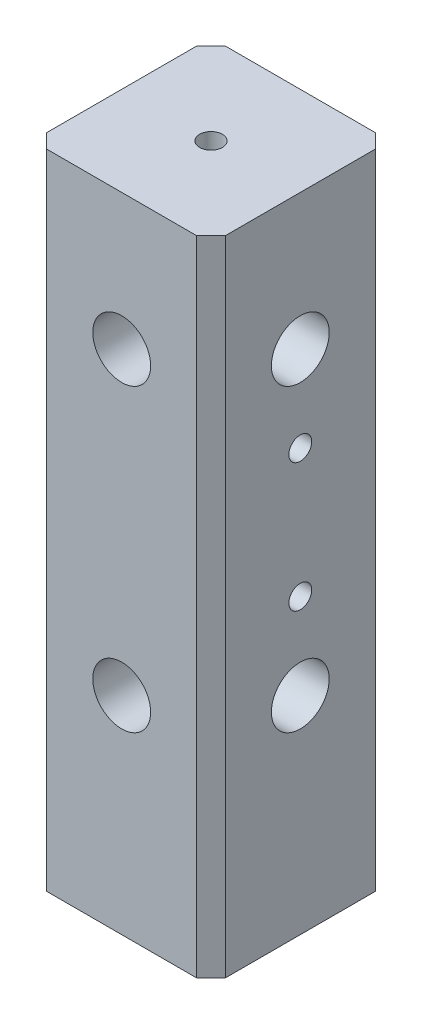
ISO-10303-21;
HEADER;
FILE_DESCRIPTION(('STEP AP214'),'2;1');
FILE_NAME('part.step','',(''),(''),'','','');
FILE_SCHEMA(('AUTOMOTIVE_DESIGN { 1 0 10303 214 1 1 1 1 }'));
ENDSEC;
DATA;
#1=APPLICATION_CONTEXT('core data for automotive mechanical design processes');
#2=APPLICATION_PROTOCOL_DEFINITION('international standard','automotive_design',2000,#1);
#3=PRODUCT_CONTEXT('',#1,'mechanical');
#4=PRODUCT('Part','Part','',(#3));
#5=PRODUCT_RELATED_PRODUCT_CATEGORY('part','',(#4));
#6=PRODUCT_DEFINITION_FORMATION('','',#4);
#7=PRODUCT_DEFINITION_CONTEXT('part definition',#1,'design');
#8=PRODUCT_DEFINITION('design','',#6,#7);
#9=PRODUCT_DEFINITION_SHAPE('','',#8);
#10=(LENGTH_UNIT() NAMED_UNIT(*) SI_UNIT(.MILLI.,.METRE.));
#11=(NAMED_UNIT(*) PLANE_ANGLE_UNIT() SI_UNIT($,.RADIAN.));
#12=(NAMED_UNIT(*) SI_UNIT($,.STERADIAN.) SOLID_ANGLE_UNIT());
#13=UNCERTAINTY_MEASURE_WITH_UNIT(LENGTH_MEASURE(1.E-05),#10,'distance_accuracy_value','');
#14=(GEOMETRIC_REPRESENTATION_CONTEXT(3) GLOBAL_UNCERTAINTY_ASSIGNED_CONTEXT((#13)) GLOBAL_UNIT_ASSIGNED_CONTEXT((#10,
#11,#12)) REPRESENTATION_CONTEXT('',''));
#15=CARTESIAN_POINT('',(0.,0.,0.));
#16=DIRECTION('',(0.,0.,1.));
#17=DIRECTION('',(1.,0.,0.));
#18=AXIS2_PLACEMENT_3D('',#15,#16,#17);
#19=CARTESIAN_POINT('',(12.5,90.,-12.5));
#20=DIRECTION('',(-1.,0.,0.));
#21=DIRECTION('',(0.,0.,1.));
#22=AXIS2_PLACEMENT_3D('',#19,#20,#21);
#23=PLANE('',#22);
#24=CARTESIAN_POINT('',(12.5,41.,0.));
#25=DIRECTION('',(1.,0.,0.));
#26=DIRECTION('',(0.,0.,-1.));
#27=AXIS2_PLACEMENT_3D('',#24,#25,#26);
#28=CIRCLE('',#27,1.6);
#29=CARTESIAN_POINT('',(12.5,41.,-1.6));
#30=VERTEX_POINT('',#29);
#31=EDGE_CURVE('E207',#30,#30,#28,.T.);
#32=ORIENTED_EDGE('',*,*,#31,.F.);
#33=EDGE_LOOP('',(#32));
#34=FACE_BOUND('',#33,.T.);
#35=CARTESIAN_POINT('',(12.5,59.,0.));
#36=DIRECTION('',(1.,0.,0.));
#37=DIRECTION('',(0.,0.,-1.));
#38=AXIS2_PLACEMENT_3D('',#35,#36,#37);
#39=CIRCLE('',#38,1.6);
#40=CARTESIAN_POINT('',(12.5,59.,-1.6));
#41=VERTEX_POINT('',#40);
#42=EDGE_CURVE('E201',#41,#41,#39,.T.);
#43=ORIENTED_EDGE('',*,*,#42,.F.);
#44=EDGE_LOOP('',(#43));
#45=FACE_BOUND('',#44,.T.);
#46=CARTESIAN_POINT('',(12.5,71.,0.));
#47=DIRECTION('',(1.,0.,0.));
#48=DIRECTION('',(0.,0.,-1.));
#49=AXIS2_PLACEMENT_3D('',#46,#47,#48);
#50=CIRCLE('',#49,4.05);
#51=CARTESIAN_POINT('',(12.5,71.,-4.05));
#52=VERTEX_POINT('',#51);
#53=EDGE_CURVE('E181',#52,#52,#50,.T.);
#54=ORIENTED_EDGE('',*,*,#53,.F.);
#55=EDGE_LOOP('',(#54));
#56=FACE_BOUND('',#55,.T.);
#57=CARTESIAN_POINT('',(12.5,29.,0.));
#58=DIRECTION('',(1.,0.,0.));
#59=DIRECTION('',(0.,0.,-1.));
#60=AXIS2_PLACEMENT_3D('',#57,#58,#59);
#61=CIRCLE('',#60,4.05);
#62=CARTESIAN_POINT('',(12.5,29.,-4.05));
#63=VERTEX_POINT('',#62);
#64=EDGE_CURVE('E133',#63,#63,#61,.T.);
#65=ORIENTED_EDGE('',*,*,#64,.F.);
#66=EDGE_LOOP('',(#65));
#67=FACE_BOUND('',#66,.T.);
#68=DIRECTION('',(0.,0.,-1.));
#69=VECTOR('',#68,1.);
#70=CARTESIAN_POINT('',(12.5,90.,-12.5));
#71=LINE('',#70,#69);
#72=CARTESIAN_POINT('',(12.5,90.,10.5));
#73=VERTEX_POINT('',#72);
#74=CARTESIAN_POINT('',(12.5,90.,-10.5));
#75=VERTEX_POINT('',#74);
#76=EDGE_CURVE('E120',#73,#75,#71,.T.);
#77=ORIENTED_EDGE('',*,*,#76,.F.);
#78=DIRECTION('',(0.,-1.,0.));
#79=VECTOR('',#78,1.);
#80=CARTESIAN_POINT('',(12.5,90.,10.5));
#81=LINE('',#80,#79);
#82=CARTESIAN_POINT('',(12.5,0.,10.5));
#83=VERTEX_POINT('',#82);
#84=EDGE_CURVE('E105',#73,#83,#81,.T.);
#85=ORIENTED_EDGE('',*,*,#84,.T.);
#86=DIRECTION('',(0.,0.,-1.));
#87=VECTOR('',#86,1.);
#88=CARTESIAN_POINT('',(12.5,0.,-12.5));
#89=LINE('',#88,#87);
#90=CARTESIAN_POINT('',(12.5,0.,-10.5));
#91=VERTEX_POINT('',#90);
#92=EDGE_CURVE('E117',#83,#91,#89,.T.);
#93=ORIENTED_EDGE('',*,*,#92,.T.);
#94=DIRECTION('',(0.,1.,0.));
#95=VECTOR('',#94,1.);
#96=CARTESIAN_POINT('',(12.5,90.,-10.5));
#97=LINE('',#96,#95);
#98=EDGE_CURVE('E122',#91,#75,#97,.T.);
#99=ORIENTED_EDGE('',*,*,#98,.T.);
#100=EDGE_LOOP('',(#77,#85,#93,#99));
#101=FACE_BOUND('',#100,.T.);
#102=ADVANCED_FACE('F35',(#34,#45,#56,#67,#101),#23,.F.);
#103=CARTESIAN_POINT('',(12.5,90.,-12.5));
#104=DIRECTION('',(0.,0.,1.));
#105=DIRECTION('',(1.,0.,0.));
#106=AXIS2_PLACEMENT_3D('',#103,#104,#105);
#107=PLANE('',#106);
#108=DIRECTION('',(-1.,0.,0.));
#109=VECTOR('',#108,1.);
#110=CARTESIAN_POINT('',(12.5,90.,-12.5));
#111=LINE('',#110,#109);
#112=CARTESIAN_POINT('',(10.5,90.,-12.5));
#113=VERTEX_POINT('',#112);
#114=CARTESIAN_POINT('',(-10.5,90.,-12.5));
#115=VERTEX_POINT('',#114);
#116=EDGE_CURVE('E166',#113,#115,#111,.T.);
#117=ORIENTED_EDGE('',*,*,#116,.F.);
#118=DIRECTION('',(0.,-1.,0.));
#119=VECTOR('',#118,1.);
#120=CARTESIAN_POINT('',(10.5,90.,-12.5));
#121=LINE('',#120,#119);
#122=CARTESIAN_POINT('',(10.5,0.,-12.5));
#123=VERTEX_POINT('',#122);
#124=EDGE_CURVE('E159',#113,#123,#121,.T.);
#125=ORIENTED_EDGE('',*,*,#124,.T.);
#126=DIRECTION('',(-1.,0.,0.));
#127=VECTOR('',#126,1.);
#128=CARTESIAN_POINT('',(12.5,0.,-12.5));
#129=LINE('',#128,#127);
#130=CARTESIAN_POINT('',(-10.5,0.,-12.5));
#131=VERTEX_POINT('',#130);
#132=EDGE_CURVE('E126',#123,#131,#129,.T.);
#133=ORIENTED_EDGE('',*,*,#132,.T.);
#134=DIRECTION('',(0.,1.,0.));
#135=VECTOR('',#134,1.);
#136=CARTESIAN_POINT('',(-10.5,90.,-12.5));
#137=LINE('',#136,#135);
#138=EDGE_CURVE('E157',#131,#115,#137,.T.);
#139=ORIENTED_EDGE('',*,*,#138,.T.);
#140=EDGE_LOOP('',(#117,#125,#133,#139));
#141=FACE_BOUND('',#140,.T.);
#142=ADVANCED_FACE('F164',(#141),#107,.F.);
#143=CARTESIAN_POINT('',(-12.5,90.,-12.5));
#144=DIRECTION('',(1.,0.,0.));
#145=DIRECTION('',(0.,0.,-1.));
#146=AXIS2_PLACEMENT_3D('',#143,#144,#145);
#147=PLANE('',#146);
#148=DIRECTION('',(0.,0.,1.));
#149=VECTOR('',#148,1.);
#150=CARTESIAN_POINT('',(-12.5,90.,-12.5));
#151=LINE('',#150,#149);
#152=CARTESIAN_POINT('',(-12.5,90.,-10.5));
#153=VERTEX_POINT('',#152);
#154=CARTESIAN_POINT('',(-12.5,90.,10.5));
#155=VERTEX_POINT('',#154);
#156=EDGE_CURVE('E174',#153,#155,#151,.T.);
#157=ORIENTED_EDGE('',*,*,#156,.F.);
#158=DIRECTION('',(0.,-1.,0.));
#159=VECTOR('',#158,1.);
#160=CARTESIAN_POINT('',(-12.5,90.,-10.5));
#161=LINE('',#160,#159);
#162=CARTESIAN_POINT('',(-12.5,0.,-10.5));
#163=VERTEX_POINT('',#162);
#164=EDGE_CURVE('E11',#153,#163,#161,.T.);
#165=ORIENTED_EDGE('',*,*,#164,.T.);
#166=DIRECTION('',(0.,0.,1.));
#167=VECTOR('',#166,1.);
#168=CARTESIAN_POINT('',(-12.5,0.,-12.5));
#169=LINE('',#168,#167);
#170=CARTESIAN_POINT('',(-12.5,0.,10.5));
#171=VERTEX_POINT('',#170);
#172=EDGE_CURVE('E130',#163,#171,#169,.T.);
#173=ORIENTED_EDGE('',*,*,#172,.T.);
#174=DIRECTION('',(0.,1.,0.));
#175=VECTOR('',#174,1.);
#176=CARTESIAN_POINT('',(-12.5,90.,10.5));
#177=LINE('',#176,#175);
#178=EDGE_CURVE('E43',#171,#155,#177,.T.);
#179=ORIENTED_EDGE('',*,*,#178,.T.);
#180=EDGE_LOOP('',(#157,#165,#173,#179));
#181=FACE_BOUND('',#180,.T.);
#182=ADVANCED_FACE('F173',(#181),#147,.F.);
#183=CARTESIAN_POINT('',(12.5,90.,12.5));
#184=DIRECTION('',(0.,0.,-1.));
#185=DIRECTION('',(-1.,0.,0.));
#186=AXIS2_PLACEMENT_3D('',#183,#184,#185);
#187=PLANE('',#186);
#188=CARTESIAN_POINT('',(0.,71.,12.5));
#189=DIRECTION('',(0.,0.,1.));
#190=DIRECTION('',(1.,0.,0.));
#191=AXIS2_PLACEMENT_3D('',#188,#189,#190);
#192=CIRCLE('',#191,4.05);
#193=CARTESIAN_POINT('',(4.05,71.,12.5));
#194=VERTEX_POINT('',#193);
#195=EDGE_CURVE('E192',#194,#194,#192,.T.);
#196=ORIENTED_EDGE('',*,*,#195,.F.);
#197=EDGE_LOOP('',(#196));
#198=FACE_BOUND('',#197,.T.);
#199=CARTESIAN_POINT('',(0.,29.,12.5));
#200=DIRECTION('',(0.,0.,1.));
#201=DIRECTION('',(1.,0.,0.));
#202=AXIS2_PLACEMENT_3D('',#199,#200,#201);
#203=CIRCLE('',#202,4.05);
#204=CARTESIAN_POINT('',(4.05,29.,12.5));
#205=VERTEX_POINT('',#204);
#206=EDGE_CURVE('E189',#205,#205,#203,.T.);
#207=ORIENTED_EDGE('',*,*,#206,.F.);
#208=EDGE_LOOP('',(#207));
#209=FACE_BOUND('',#208,.T.);
#210=DIRECTION('',(1.,0.,0.));
#211=VECTOR('',#210,1.);
#212=CARTESIAN_POINT('',(12.5,0.,12.5));
#213=LINE('',#212,#211);
#214=CARTESIAN_POINT('',(-10.5,0.,12.5));
#215=VERTEX_POINT('',#214);
#216=CARTESIAN_POINT('',(10.5,0.,12.5));
#217=VERTEX_POINT('',#216);
#218=EDGE_CURVE('E140',#215,#217,#213,.T.);
#219=ORIENTED_EDGE('',*,*,#218,.T.);
#220=DIRECTION('',(0.,1.,0.));
#221=VECTOR('',#220,1.);
#222=CARTESIAN_POINT('',(10.5,90.,12.5));
#223=LINE('',#222,#221);
#224=CARTESIAN_POINT('',(10.5,90.,12.5));
#225=VERTEX_POINT('',#224);
#226=EDGE_CURVE('E106',#217,#225,#223,.T.);
#227=ORIENTED_EDGE('',*,*,#226,.T.);
#228=DIRECTION('',(1.,0.,0.));
#229=VECTOR('',#228,1.);
#230=CARTESIAN_POINT('',(12.5,90.,12.5));
#231=LINE('',#230,#229);
#232=CARTESIAN_POINT('',(-10.5,90.,12.5));
#233=VERTEX_POINT('',#232);
#234=EDGE_CURVE('E136',#233,#225,#231,.T.);
#235=ORIENTED_EDGE('',*,*,#234,.F.);
#236=DIRECTION('',(0.,-1.,0.));
#237=VECTOR('',#236,1.);
#238=CARTESIAN_POINT('',(-10.5,90.,12.5));
#239=LINE('',#238,#237);
#240=EDGE_CURVE('E111',#233,#215,#239,.T.);
#241=ORIENTED_EDGE('',*,*,#240,.T.);
#242=EDGE_LOOP('',(#219,#227,#235,#241));
#243=FACE_BOUND('',#242,.T.);
#244=ADVANCED_FACE('F230',(#198,#209,#243),#187,.F.);
#245=CARTESIAN_POINT('',(12.5,90.,12.5));
#246=DIRECTION('',(0.,-1.,0.));
#247=DIRECTION('',(0.,0.,-1.));
#248=AXIS2_PLACEMENT_3D('',#245,#246,#247);
#249=PLANE('',#248);
#250=CARTESIAN_POINT('',(0.,90.,0.));
#251=DIRECTION('',(0.,1.,0.));
#252=DIRECTION('',(0.,0.,1.));
#253=AXIS2_PLACEMENT_3D('',#250,#251,#252);
#254=CIRCLE('',#253,1.6);
#255=CARTESIAN_POINT('',(0.,90.,1.6));
#256=VERTEX_POINT('',#255);
#257=EDGE_CURVE('E213',#256,#256,#254,.T.);
#258=ORIENTED_EDGE('',*,*,#257,.F.);
#259=EDGE_LOOP('',(#258));
#260=FACE_BOUND('',#259,.T.);
#261=ORIENTED_EDGE('',*,*,#234,.T.);
#262=DIRECTION('',(-0.70710678118655,0.,0.707106781186545));
#263=VECTOR('',#262,1.);
#264=CARTESIAN_POINT('',(12.5,90.,10.5));
#265=LINE('',#264,#263);
#266=EDGE_CURVE('E155',#225,#73,#265,.F.);
#267=ORIENTED_EDGE('',*,*,#266,.T.);
#268=ORIENTED_EDGE('',*,*,#76,.T.);
#269=DIRECTION('',(0.707106781186545,0.,0.70710678118655));
#270=VECTOR('',#269,1.);
#271=CARTESIAN_POINT('',(10.5,90.,-12.5));
#272=LINE('',#271,#270);
#273=EDGE_CURVE('E153',#75,#113,#272,.F.);
#274=ORIENTED_EDGE('',*,*,#273,.T.);
#275=ORIENTED_EDGE('',*,*,#116,.T.);
#276=DIRECTION('',(0.707106781186551,0.,-0.707106781186544));
#277=VECTOR('',#276,1.);
#278=CARTESIAN_POINT('',(-12.5,90.,-10.5));
#279=LINE('',#278,#277);
#280=EDGE_CURVE('E56',#115,#153,#279,.F.);
#281=ORIENTED_EDGE('',*,*,#280,.T.);
#282=ORIENTED_EDGE('',*,*,#156,.T.);
#283=DIRECTION('',(-0.707106781186545,0.,-0.70710678118655));
#284=VECTOR('',#283,1.);
#285=CARTESIAN_POINT('',(-10.5,90.,12.5));
#286=LINE('',#285,#284);
#287=EDGE_CURVE('E150',#155,#233,#286,.F.);
#288=ORIENTED_EDGE('',*,*,#287,.T.);
#289=EDGE_LOOP('',(#261,#267,#268,#274,#275,#281,#282,#288));
#290=FACE_BOUND('',#289,.T.);
#291=ADVANCED_FACE('F228',(#260,#290),#249,.F.);
#292=CARTESIAN_POINT('',(12.5,0.,12.5));
#293=DIRECTION('',(0.,-1.,0.));
#294=DIRECTION('',(0.,0.,-1.));
#295=AXIS2_PLACEMENT_3D('',#292,#293,#294);
#296=PLANE('',#295);
#297=ORIENTED_EDGE('',*,*,#92,.F.);
#298=DIRECTION('',(0.70710678118655,0.,-0.707106781186545));
#299=VECTOR('',#298,1.);
#300=CARTESIAN_POINT('',(11.5,0.,11.5));
#301=LINE('',#300,#299);
#302=EDGE_CURVE('E101',#83,#217,#301,.F.);
#303=ORIENTED_EDGE('',*,*,#302,.T.);
#304=ORIENTED_EDGE('',*,*,#218,.F.);
#305=DIRECTION('',(0.707106781186545,0.,0.70710678118655));
#306=VECTOR('',#305,1.);
#307=CARTESIAN_POINT('',(0.999999999999912,0.,24.));
#308=LINE('',#307,#306);
#309=EDGE_CURVE('E121',#215,#171,#308,.F.);
#310=ORIENTED_EDGE('',*,*,#309,.T.);
#311=ORIENTED_EDGE('',*,*,#172,.F.);
#312=DIRECTION('',(-0.707106781186551,0.,0.707106781186544));
#313=VECTOR('',#312,1.);
#314=CARTESIAN_POINT('',(-11.4999999999999,0.,-11.5000000000001));
#315=LINE('',#314,#313);
#316=EDGE_CURVE('E144',#163,#131,#315,.F.);
#317=ORIENTED_EDGE('',*,*,#316,.T.);
#318=ORIENTED_EDGE('',*,*,#132,.F.);
#319=DIRECTION('',(-0.707106781186545,0.,-0.70710678118655));
#320=VECTOR('',#319,1.);
#321=CARTESIAN_POINT('',(24.,0.,1.00000000000007));
#322=LINE('',#321,#320);
#323=EDGE_CURVE('E112',#123,#91,#322,.F.);
#324=ORIENTED_EDGE('',*,*,#323,.T.);
#325=EDGE_LOOP('',(#297,#303,#304,#310,#311,#317,#318,#324));
#326=FACE_BOUND('',#325,.T.);
#327=ADVANCED_FACE('F124',(#326),#296,.T.);
#328=CARTESIAN_POINT('',(4.5,29.,0.));
#329=DIRECTION('',(1.,0.,0.));
#330=DIRECTION('',(0.,0.,-1.));
#331=AXIS2_PLACEMENT_3D('',#328,#329,#330);
#332=CYLINDRICAL_SURFACE('',#331,4.05);
#333=CARTESIAN_POINT('',(4.5,29.,0.));
#334=DIRECTION('',(1.,0.,0.));
#335=DIRECTION('',(0.,0.,-1.));
#336=AXIS2_PLACEMENT_3D('',#333,#334,#335);
#337=CIRCLE('',#336,4.05);
#338=CARTESIAN_POINT('',(4.5,29.,-4.05));
#339=VERTEX_POINT('',#338);
#340=EDGE_CURVE('E127',#339,#339,#337,.T.);
#341=ORIENTED_EDGE('',*,*,#340,.F.);
#342=EDGE_LOOP('',(#341));
#343=FACE_BOUND('',#342,.T.);
#344=ORIENTED_EDGE('',*,*,#64,.T.);
#345=EDGE_LOOP('',(#344));
#346=FACE_BOUND('',#345,.T.);
#347=ADVANCED_FACE('F368',(#343,#346),#332,.F.);
#348=CARTESIAN_POINT('',(4.5,29.,0.));
#349=DIRECTION('',(1.,0.,0.));
#350=DIRECTION('',(0.,0.,-1.));
#351=AXIS2_PLACEMENT_3D('',#348,#349,#350);
#352=PLANE('',#351);
#353=ORIENTED_EDGE('',*,*,#340,.T.);
#354=EDGE_LOOP('',(#353));
#355=FACE_BOUND('',#354,.T.);
#356=ADVANCED_FACE('F361',(#355),#352,.T.);
#357=CARTESIAN_POINT('',(4.5,71.,0.));
#358=DIRECTION('',(1.,0.,0.));
#359=DIRECTION('',(0.,0.,-1.));
#360=AXIS2_PLACEMENT_3D('',#357,#358,#359);
#361=CYLINDRICAL_SURFACE('',#360,4.05);
#362=CARTESIAN_POINT('',(4.5,71.,0.));
#363=DIRECTION('',(1.,0.,0.));
#364=DIRECTION('',(0.,0.,-1.));
#365=AXIS2_PLACEMENT_3D('',#362,#363,#364);
#366=CIRCLE('',#365,4.05);
#367=CARTESIAN_POINT('',(4.5,71.,-4.04999999999999));
#368=VERTEX_POINT('',#367);
#369=EDGE_CURVE('E183',#368,#368,#366,.T.);
#370=ORIENTED_EDGE('',*,*,#369,.F.);
#371=EDGE_LOOP('',(#370));
#372=FACE_BOUND('',#371,.T.);
#373=ORIENTED_EDGE('',*,*,#53,.T.);
#374=EDGE_LOOP('',(#373));
#375=FACE_BOUND('',#374,.T.);
#376=ADVANCED_FACE('F358',(#372,#375),#361,.F.);
#377=CARTESIAN_POINT('',(4.5,71.,0.));
#378=DIRECTION('',(1.,0.,0.));
#379=DIRECTION('',(0.,0.,-1.));
#380=AXIS2_PLACEMENT_3D('',#377,#378,#379);
#381=PLANE('',#380);
#382=ORIENTED_EDGE('',*,*,#369,.T.);
#383=EDGE_LOOP('',(#382));
#384=FACE_BOUND('',#383,.T.);
#385=ADVANCED_FACE('F356',(#384),#381,.T.);
#386=CARTESIAN_POINT('',(0.,29.,4.5));
#387=DIRECTION('',(0.,0.,1.));
#388=DIRECTION('',(1.,0.,0.));
#389=AXIS2_PLACEMENT_3D('',#386,#387,#388);
#390=CYLINDRICAL_SURFACE('',#389,4.05);
#391=CARTESIAN_POINT('',(0.,29.,4.5));
#392=DIRECTION('',(0.,0.,1.));
#393=DIRECTION('',(1.,0.,0.));
#394=AXIS2_PLACEMENT_3D('',#391,#392,#393);
#395=CIRCLE('',#394,4.05);
#396=CARTESIAN_POINT('',(4.05,29.,4.5));
#397=VERTEX_POINT('',#396);
#398=EDGE_CURVE('E186',#397,#397,#395,.T.);
#399=ORIENTED_EDGE('',*,*,#398,.F.);
#400=EDGE_LOOP('',(#399));
#401=FACE_BOUND('',#400,.T.);
#402=ORIENTED_EDGE('',*,*,#206,.T.);
#403=EDGE_LOOP('',(#402));
#404=FACE_BOUND('',#403,.T.);
#405=ADVANCED_FACE('F352',(#401,#404),#390,.F.);
#406=CARTESIAN_POINT('',(0.,29.,4.5));
#407=DIRECTION('',(0.,0.,1.));
#408=DIRECTION('',(1.,0.,0.));
#409=AXIS2_PLACEMENT_3D('',#406,#407,#408);
#410=PLANE('',#409);
#411=ORIENTED_EDGE('',*,*,#398,.T.);
#412=EDGE_LOOP('',(#411));
#413=FACE_BOUND('',#412,.T.);
#414=ADVANCED_FACE('F346',(#413),#410,.T.);
#415=CARTESIAN_POINT('',(0.,71.,4.5));
#416=DIRECTION('',(0.,0.,1.));
#417=DIRECTION('',(1.,0.,0.));
#418=AXIS2_PLACEMENT_3D('',#415,#416,#417);
#419=CYLINDRICAL_SURFACE('',#418,4.05);
#420=CARTESIAN_POINT('',(0.,71.,4.5));
#421=DIRECTION('',(0.,0.,1.));
#422=DIRECTION('',(1.,0.,0.));
#423=AXIS2_PLACEMENT_3D('',#420,#421,#422);
#424=CIRCLE('',#423,4.05);
#425=CARTESIAN_POINT('',(4.05,71.,4.5));
#426=VERTEX_POINT('',#425);
#427=EDGE_CURVE('E195',#426,#426,#424,.T.);
#428=ORIENTED_EDGE('',*,*,#427,.F.);
#429=EDGE_LOOP('',(#428));
#430=FACE_BOUND('',#429,.T.);
#431=ORIENTED_EDGE('',*,*,#195,.T.);
#432=EDGE_LOOP('',(#431));
#433=FACE_BOUND('',#432,.T.);
#434=ADVANCED_FACE('F343',(#430,#433),#419,.F.);
#435=CARTESIAN_POINT('',(0.,71.,4.5));
#436=DIRECTION('',(0.,0.,1.));
#437=DIRECTION('',(1.,0.,0.));
#438=AXIS2_PLACEMENT_3D('',#435,#436,#437);
#439=PLANE('',#438);
#440=ORIENTED_EDGE('',*,*,#427,.T.);
#441=EDGE_LOOP('',(#440));
#442=FACE_BOUND('',#441,.T.);
#443=ADVANCED_FACE('F259',(#442),#439,.T.);
#444=CARTESIAN_POINT('',(12.5,90.,10.5));
#445=DIRECTION('',(-0.707106781186545,0.,-0.70710678118655));
#446=DIRECTION('',(-0.70710678118655,0.,0.707106781186545));
#447=AXIS2_PLACEMENT_3D('',#444,#445,#446);
#448=PLANE('',#447);
#449=ORIENTED_EDGE('',*,*,#266,.F.);
#450=ORIENTED_EDGE('',*,*,#226,.F.);
#451=ORIENTED_EDGE('',*,*,#302,.F.);
#452=ORIENTED_EDGE('',*,*,#84,.F.);
#453=EDGE_LOOP('',(#449,#450,#451,#452));
#454=FACE_BOUND('',#453,.T.);
#455=ADVANCED_FACE('F104',(#454),#448,.F.);
#456=CARTESIAN_POINT('',(10.5,90.,-12.5));
#457=DIRECTION('',(-0.70710678118655,0.,0.707106781186545));
#458=DIRECTION('',(0.707106781186545,0.,0.70710678118655));
#459=AXIS2_PLACEMENT_3D('',#456,#457,#458);
#460=PLANE('',#459);
#461=ORIENTED_EDGE('',*,*,#273,.F.);
#462=ORIENTED_EDGE('',*,*,#98,.F.);
#463=ORIENTED_EDGE('',*,*,#323,.F.);
#464=ORIENTED_EDGE('',*,*,#124,.F.);
#465=EDGE_LOOP('',(#461,#462,#463,#464));
#466=FACE_BOUND('',#465,.T.);
#467=ADVANCED_FACE('F245',(#466),#460,.F.);
#468=CARTESIAN_POINT('',(-12.5,90.,-10.5));
#469=DIRECTION('',(0.707106781186544,0.,0.707106781186551));
#470=DIRECTION('',(0.707106781186551,0.,-0.707106781186544));
#471=AXIS2_PLACEMENT_3D('',#468,#469,#470);
#472=PLANE('',#471);
#473=ORIENTED_EDGE('',*,*,#280,.F.);
#474=ORIENTED_EDGE('',*,*,#138,.F.);
#475=ORIENTED_EDGE('',*,*,#316,.F.);
#476=ORIENTED_EDGE('',*,*,#164,.F.);
#477=EDGE_LOOP('',(#473,#474,#475,#476));
#478=FACE_BOUND('',#477,.T.);
#479=ADVANCED_FACE('F172',(#478),#472,.F.);
#480=CARTESIAN_POINT('',(-10.5,90.,12.5));
#481=DIRECTION('',(0.70710678118655,0.,-0.707106781186545));
#482=DIRECTION('',(-0.707106781186545,0.,-0.70710678118655));
#483=AXIS2_PLACEMENT_3D('',#480,#481,#482);
#484=PLANE('',#483);
#485=ORIENTED_EDGE('',*,*,#287,.F.);
#486=ORIENTED_EDGE('',*,*,#178,.F.);
#487=ORIENTED_EDGE('',*,*,#309,.F.);
#488=ORIENTED_EDGE('',*,*,#240,.F.);
#489=EDGE_LOOP('',(#485,#486,#487,#488));
#490=FACE_BOUND('',#489,.T.);
#491=ADVANCED_FACE('F37',(#490),#484,.F.);
#492=CARTESIAN_POINT('',(0.,59.,0.));
#493=DIRECTION('',(1.,0.,0.));
#494=DIRECTION('',(0.,0.,-1.));
#495=AXIS2_PLACEMENT_3D('',#492,#493,#494);
#496=CYLINDRICAL_SURFACE('',#495,1.6);
#497=CARTESIAN_POINT('',(0.,59.,0.));
#498=DIRECTION('',(1.,0.,0.));
#499=DIRECTION('',(0.,0.,-1.));
#500=AXIS2_PLACEMENT_3D('',#497,#498,#499);
#501=CIRCLE('',#500,1.6);
#502=CARTESIAN_POINT('',(0.,59.,-1.6));
#503=VERTEX_POINT('',#502);
#504=EDGE_CURVE('E198',#503,#503,#501,.T.);
#505=ORIENTED_EDGE('',*,*,#504,.F.);
#506=EDGE_LOOP('',(#505));
#507=FACE_BOUND('',#506,.T.);
#508=ORIENTED_EDGE('',*,*,#42,.T.);
#509=EDGE_LOOP('',(#508));
#510=FACE_BOUND('',#509,.T.);
#511=ADVANCED_FACE('F237',(#507,#510),#496,.F.);
#512=CARTESIAN_POINT('',(0.,59.,0.));
#513=DIRECTION('',(1.,0.,0.));
#514=DIRECTION('',(0.,0.,-1.));
#515=AXIS2_PLACEMENT_3D('',#512,#513,#514);
#516=PLANE('',#515);
#517=ORIENTED_EDGE('',*,*,#504,.T.);
#518=EDGE_LOOP('',(#517));
#519=FACE_BOUND('',#518,.T.);
#520=ADVANCED_FACE('F242',(#519),#516,.T.);
#521=CARTESIAN_POINT('',(0.,41.,0.));
#522=DIRECTION('',(1.,0.,0.));
#523=DIRECTION('',(0.,0.,-1.));
#524=AXIS2_PLACEMENT_3D('',#521,#522,#523);
#525=CYLINDRICAL_SURFACE('',#524,1.6);
#526=CARTESIAN_POINT('',(0.,41.,0.));
#527=DIRECTION('',(1.,0.,0.));
#528=DIRECTION('',(0.,0.,-1.));
#529=AXIS2_PLACEMENT_3D('',#526,#527,#528);
#530=CIRCLE('',#529,1.6);
#531=CARTESIAN_POINT('',(0.,41.,-1.6));
#532=VERTEX_POINT('',#531);
#533=EDGE_CURVE('E204',#532,#532,#530,.T.);
#534=ORIENTED_EDGE('',*,*,#533,.F.);
#535=EDGE_LOOP('',(#534));
#536=FACE_BOUND('',#535,.T.);
#537=ORIENTED_EDGE('',*,*,#31,.T.);
#538=EDGE_LOOP('',(#537));
#539=FACE_BOUND('',#538,.T.);
#540=ADVANCED_FACE('F295',(#536,#539),#525,.F.);
#541=CARTESIAN_POINT('',(0.,41.,0.));
#542=DIRECTION('',(1.,0.,0.));
#543=DIRECTION('',(0.,0.,-1.));
#544=AXIS2_PLACEMENT_3D('',#541,#542,#543);
#545=PLANE('',#544);
#546=ORIENTED_EDGE('',*,*,#533,.T.);
#547=EDGE_LOOP('',(#546));
#548=FACE_BOUND('',#547,.T.);
#549=ADVANCED_FACE('F224',(#548),#545,.T.);
#550=CARTESIAN_POINT('',(0.,80.,0.));
#551=DIRECTION('',(0.,1.,0.));
#552=DIRECTION('',(0.,0.,1.));
#553=AXIS2_PLACEMENT_3D('',#550,#551,#552);
#554=CYLINDRICAL_SURFACE('',#553,1.6);
#555=CARTESIAN_POINT('',(0.,80.,0.));
#556=DIRECTION('',(0.,1.,0.));
#557=DIRECTION('',(0.,0.,1.));
#558=AXIS2_PLACEMENT_3D('',#555,#556,#557);
#559=CIRCLE('',#558,1.6);
#560=CARTESIAN_POINT('',(0.,80.,1.6));
#561=VERTEX_POINT('',#560);
#562=EDGE_CURVE('E210',#561,#561,#559,.T.);
#563=ORIENTED_EDGE('',*,*,#562,.F.);
#564=EDGE_LOOP('',(#563));
#565=FACE_BOUND('',#564,.T.);
#566=ORIENTED_EDGE('',*,*,#257,.T.);
#567=EDGE_LOOP('',(#566));
#568=FACE_BOUND('',#567,.T.);
#569=ADVANCED_FACE('F221',(#565,#568),#554,.F.);
#570=CARTESIAN_POINT('',(0.,80.,0.));
#571=DIRECTION('',(0.,1.,0.));
#572=DIRECTION('',(0.,0.,1.));
#573=AXIS2_PLACEMENT_3D('',#570,#571,#572);
#574=PLANE('',#573);
#575=ORIENTED_EDGE('',*,*,#562,.T.);
#576=EDGE_LOOP('',(#575));
#577=FACE_BOUND('',#576,.T.);
#578=ADVANCED_FACE('F219',(#577),#574,.T.);
#579=CLOSED_SHELL('',(#102,#142,#182,#244,#291,#327,#347,#356,#376,#385,#405,#414,#434,#443,
#455,#467,#479,#491,#511,#520,#540,#549,#569,#578));
#580=MANIFOLD_SOLID_BREP('B2',#579);
#581=ADVANCED_BREP_SHAPE_REPRESENTATION('',(#18,#580),#14);
#582=SHAPE_DEFINITION_REPRESENTATION(#9,#581);
ENDSEC;
END-ISO-10303-21;
